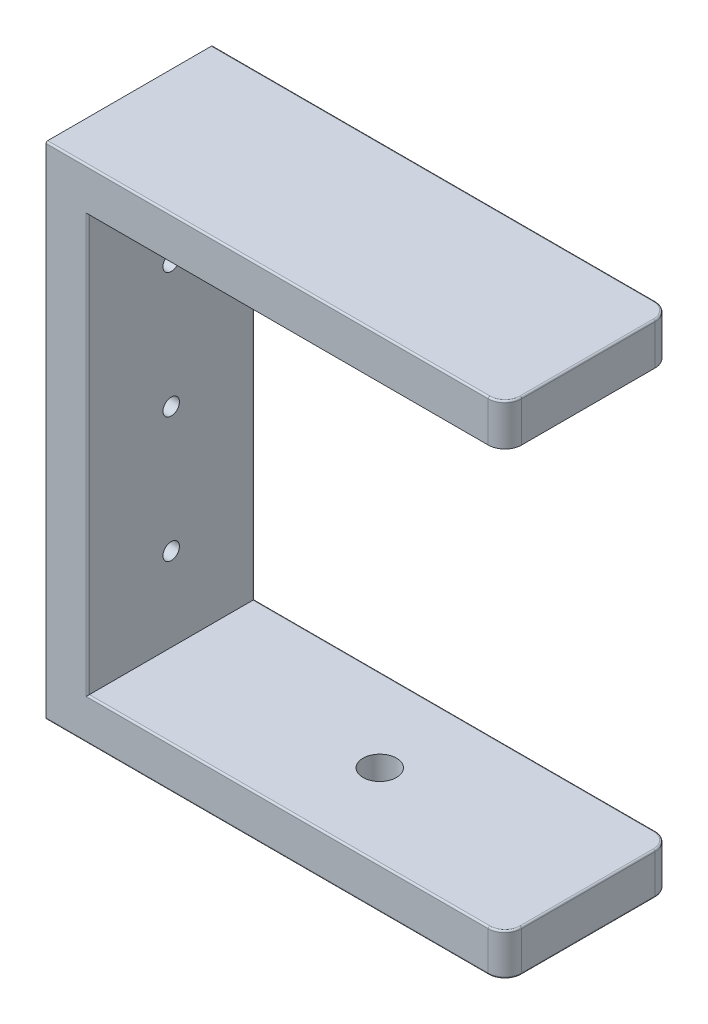
ISO-10303-21;
HEADER;
FILE_DESCRIPTION(('STEP AP214'),'2;1');
FILE_NAME('part.step','',(''),(''),'','','');
FILE_SCHEMA(('AUTOMOTIVE_DESIGN { 1 0 10303 214 1 1 1 1 }'));
ENDSEC;
DATA;
#1=APPLICATION_CONTEXT('core data for automotive mechanical design processes');
#2=APPLICATION_PROTOCOL_DEFINITION('international standard','automotive_design',2000,#1);
#3=PRODUCT_CONTEXT('',#1,'mechanical');
#4=PRODUCT('Part','Part','',(#3));
#5=PRODUCT_RELATED_PRODUCT_CATEGORY('part','',(#4));
#6=PRODUCT_DEFINITION_FORMATION('','',#4);
#7=PRODUCT_DEFINITION_CONTEXT('part definition',#1,'design');
#8=PRODUCT_DEFINITION('design','',#6,#7);
#9=PRODUCT_DEFINITION_SHAPE('','',#8);
#10=(LENGTH_UNIT() NAMED_UNIT(*) SI_UNIT(.MILLI.,.METRE.));
#11=(NAMED_UNIT(*) PLANE_ANGLE_UNIT() SI_UNIT($,.RADIAN.));
#12=(NAMED_UNIT(*) SI_UNIT($,.STERADIAN.) SOLID_ANGLE_UNIT());
#13=UNCERTAINTY_MEASURE_WITH_UNIT(LENGTH_MEASURE(1.E-05),#10,'distance_accuracy_value','');
#14=(GEOMETRIC_REPRESENTATION_CONTEXT(3) GLOBAL_UNCERTAINTY_ASSIGNED_CONTEXT((#13)) GLOBAL_UNIT_ASSIGNED_CONTEXT((#10,
#11,#12)) REPRESENTATION_CONTEXT('',''));
#15=CARTESIAN_POINT('',(0.,0.,0.));
#16=DIRECTION('',(0.,0.,1.));
#17=DIRECTION('',(1.,0.,0.));
#18=AXIS2_PLACEMENT_3D('',#15,#16,#17);
#19=CARTESIAN_POINT('',(0.,0.,25.4));
#20=DIRECTION('',(1.,0.,0.));
#21=DIRECTION('',(0.,0.,-1.));
#22=AXIS2_PLACEMENT_3D('',#19,#20,#21);
#23=PLANE('',#22);
#24=CARTESIAN_POINT('',(0.,57.15,12.7));
#25=DIRECTION('',(-1.,0.,0.));
#26=DIRECTION('',(0.,0.,1.));
#27=AXIS2_PLACEMENT_3D('',#24,#25,#26);
#28=CIRCLE('',#27,1.24999999999999);
#29=CARTESIAN_POINT('',(0.,57.15,13.95));
#30=VERTEX_POINT('',#29);
#31=EDGE_CURVE('E391',#30,#30,#28,.T.);
#32=ORIENTED_EDGE('',*,*,#31,.F.);
#33=EDGE_LOOP('',(#32));
#34=FACE_BOUND('',#33,.T.);
#35=CARTESIAN_POINT('',(0.,38.1,12.7));
#36=DIRECTION('',(-1.,0.,0.));
#37=DIRECTION('',(0.,0.,1.));
#38=AXIS2_PLACEMENT_3D('',#35,#36,#37);
#39=CIRCLE('',#38,1.24999999999999);
#40=CARTESIAN_POINT('',(0.,38.1,13.95));
#41=VERTEX_POINT('',#40);
#42=EDGE_CURVE('E390',#41,#41,#39,.T.);
#43=ORIENTED_EDGE('',*,*,#42,.F.);
#44=EDGE_LOOP('',(#43));
#45=FACE_BOUND('',#44,.T.);
#46=CARTESIAN_POINT('',(0.,19.05,12.7));
#47=DIRECTION('',(-1.,0.,0.));
#48=DIRECTION('',(0.,0.,1.));
#49=AXIS2_PLACEMENT_3D('',#46,#47,#48);
#50=CIRCLE('',#49,1.24999999999999);
#51=CARTESIAN_POINT('',(0.,19.05,13.95));
#52=VERTEX_POINT('',#51);
#53=EDGE_CURVE('E593',#52,#52,#50,.T.);
#54=ORIENTED_EDGE('',*,*,#53,.F.);
#55=EDGE_LOOP('',(#54));
#56=FACE_BOUND('',#55,.T.);
#57=DIRECTION('',(0.,-1.,0.));
#58=VECTOR('',#57,1.);
#59=CARTESIAN_POINT('',(0.,0.,0.));
#60=LINE('',#59,#58);
#61=CARTESIAN_POINT('',(0.,75.946,0.));
#62=VERTEX_POINT('',#61);
#63=CARTESIAN_POINT('',(0.,0.254,0.));
#64=VERTEX_POINT('',#63);
#65=EDGE_CURVE('E212',#62,#64,#60,.T.);
#66=ORIENTED_EDGE('',*,*,#65,.T.);
#67=CARTESIAN_POINT('',(0.,0.254,0.254000000000001));
#68=DIRECTION('',(1.,0.,0.));
#69=DIRECTION('',(0.,0.,-1.));
#70=AXIS2_PLACEMENT_3D('',#67,#68,#69);
#71=CIRCLE('',#70,0.254);
#72=CARTESIAN_POINT('',(0.,0.,0.254000000000001));
#73=VERTEX_POINT('',#72);
#74=EDGE_CURVE('E270',#64,#73,#71,.F.);
#75=ORIENTED_EDGE('',*,*,#74,.T.);
#76=DIRECTION('',(0.,0.,-1.));
#77=VECTOR('',#76,1.);
#78=CARTESIAN_POINT('',(0.,0.,25.4));
#79=LINE('',#78,#77);
#80=CARTESIAN_POINT('',(0.,0.,25.146));
#81=VERTEX_POINT('',#80);
#82=EDGE_CURVE('E383',#81,#73,#79,.T.);
#83=ORIENTED_EDGE('',*,*,#82,.F.);
#84=CARTESIAN_POINT('',(0.,0.254,25.146));
#85=DIRECTION('',(1.,0.,0.));
#86=DIRECTION('',(0.,0.,-1.));
#87=AXIS2_PLACEMENT_3D('',#84,#85,#86);
#88=CIRCLE('',#87,0.254);
#89=CARTESIAN_POINT('',(0.,0.254,25.4));
#90=VERTEX_POINT('',#89);
#91=EDGE_CURVE('E266',#81,#90,#88,.F.);
#92=ORIENTED_EDGE('',*,*,#91,.T.);
#93=DIRECTION('',(0.,-1.,0.));
#94=VECTOR('',#93,1.);
#95=CARTESIAN_POINT('',(0.,0.,25.4));
#96=LINE('',#95,#94);
#97=CARTESIAN_POINT('',(0.,75.946,25.4));
#98=VERTEX_POINT('',#97);
#99=EDGE_CURVE('E211',#98,#90,#96,.T.);
#100=ORIENTED_EDGE('',*,*,#99,.F.);
#101=CARTESIAN_POINT('',(0.,75.946,25.146));
#102=DIRECTION('',(1.,0.,0.));
#103=DIRECTION('',(0.,0.,-1.));
#104=AXIS2_PLACEMENT_3D('',#101,#102,#103);
#105=CIRCLE('',#104,0.254);
#106=CARTESIAN_POINT('',(0.,76.2,25.146));
#107=VERTEX_POINT('',#106);
#108=EDGE_CURVE('E264',#98,#107,#105,.F.);
#109=ORIENTED_EDGE('',*,*,#108,.T.);
#110=DIRECTION('',(0.,0.,-1.));
#111=VECTOR('',#110,1.);
#112=CARTESIAN_POINT('',(0.,76.2,25.4));
#113=LINE('',#112,#111);
#114=CARTESIAN_POINT('',(0.,76.2,0.254000000000001));
#115=VERTEX_POINT('',#114);
#116=EDGE_CURVE('E369',#107,#115,#113,.T.);
#117=ORIENTED_EDGE('',*,*,#116,.T.);
#118=CARTESIAN_POINT('',(0.,75.946,0.254000000000001));
#119=DIRECTION('',(1.,0.,0.));
#120=DIRECTION('',(0.,0.,-1.));
#121=AXIS2_PLACEMENT_3D('',#118,#119,#120);
#122=CIRCLE('',#121,0.254);
#123=EDGE_CURVE('E268',#115,#62,#122,.F.);
#124=ORIENTED_EDGE('',*,*,#123,.T.);
#125=EDGE_LOOP('',(#66,#75,#83,#92,#100,#109,#117,#124));
#126=FACE_BOUND('',#125,.T.);
#127=ADVANCED_FACE('F41',(#34,#45,#56,#126),#23,.F.);
#128=CARTESIAN_POINT('',(0.,0.,25.4));
#129=DIRECTION('',(0.,1.,0.));
#130=DIRECTION('',(0.,0.,1.));
#131=AXIS2_PLACEMENT_3D('',#128,#129,#130);
#132=PLANE('',#131);
#133=CARTESIAN_POINT('',(38.1,0.,12.7));
#134=DIRECTION('',(0.,-1.,0.));
#135=DIRECTION('',(0.,0.,-1.));
#136=AXIS2_PLACEMENT_3D('',#133,#134,#135);
#137=CIRCLE('',#136,2.5527);
#138=CARTESIAN_POINT('',(38.1,0.,10.1473));
#139=VERTEX_POINT('',#138);
#140=EDGE_CURVE('E320',#139,#139,#137,.T.);
#141=ORIENTED_EDGE('',*,*,#140,.F.);
#142=EDGE_LOOP('',(#141));
#143=FACE_BOUND('',#142,.T.);
#144=ORIENTED_EDGE('',*,*,#82,.T.);
#145=DIRECTION('',(1.,0.,0.));
#146=VECTOR('',#145,1.);
#147=CARTESIAN_POINT('',(67.31,0.,0.254000000000001));
#148=LINE('',#147,#146);
#149=CARTESIAN_POINT('',(67.31,0.,0.254));
#150=VERTEX_POINT('',#149);
#151=EDGE_CURVE('E261',#73,#150,#148,.T.);
#152=ORIENTED_EDGE('',*,*,#151,.T.);
#153=CARTESIAN_POINT('',(67.31,0.,2.54));
#154=DIRECTION('',(0.,1.,0.));
#155=DIRECTION('',(0.,0.,1.));
#156=AXIS2_PLACEMENT_3D('',#153,#154,#155);
#157=CIRCLE('',#156,2.286);
#158=CARTESIAN_POINT('',(69.596,0.,2.54));
#159=VERTEX_POINT('',#158);
#160=EDGE_CURVE('E259',#150,#159,#157,.F.);
#161=ORIENTED_EDGE('',*,*,#160,.T.);
#162=DIRECTION('',(0.,0.,-1.));
#163=VECTOR('',#162,1.);
#164=CARTESIAN_POINT('',(69.596,0.,25.4));
#165=LINE('',#164,#163);
#166=CARTESIAN_POINT('',(69.596,0.,22.86));
#167=VERTEX_POINT('',#166);
#168=EDGE_CURVE('E257',#159,#167,#165,.F.);
#169=ORIENTED_EDGE('',*,*,#168,.T.);
#170=CARTESIAN_POINT('',(67.31,0.,22.86));
#171=DIRECTION('',(0.,1.,0.));
#172=DIRECTION('',(0.,0.,1.));
#173=AXIS2_PLACEMENT_3D('',#170,#171,#172);
#174=CIRCLE('',#173,2.286);
#175=CARTESIAN_POINT('',(67.31,0.,25.146));
#176=VERTEX_POINT('',#175);
#177=EDGE_CURVE('E255',#167,#176,#174,.F.);
#178=ORIENTED_EDGE('',*,*,#177,.T.);
#179=DIRECTION('',(1.,0.,0.));
#180=VECTOR('',#179,1.);
#181=CARTESIAN_POINT('',(0.,0.,25.146));
#182=LINE('',#181,#180);
#183=EDGE_CURVE('E253',#176,#81,#182,.F.);
#184=ORIENTED_EDGE('',*,*,#183,.T.);
#185=EDGE_LOOP('',(#144,#152,#161,#169,#178,#184));
#186=FACE_BOUND('',#185,.T.);
#187=ADVANCED_FACE('F426',(#143,#186),#132,.F.);
#188=CARTESIAN_POINT('',(69.85,0.,25.4));
#189=DIRECTION('',(-1.,0.,0.));
#190=DIRECTION('',(0.,0.,1.));
#191=AXIS2_PLACEMENT_3D('',#188,#189,#190);
#192=PLANE('',#191);
#193=DIRECTION('',(0.,1.,0.));
#194=VECTOR('',#193,1.);
#195=CARTESIAN_POINT('',(69.85,6.35,2.54));
#196=LINE('',#195,#194);
#197=CARTESIAN_POINT('',(69.85,0.254,2.54));
#198=VERTEX_POINT('',#197);
#199=CARTESIAN_POINT('',(69.85,6.096,2.54));
#200=VERTEX_POINT('',#199);
#201=EDGE_CURVE('E203',#198,#200,#196,.T.);
#202=ORIENTED_EDGE('',*,*,#201,.T.);
#203=DIRECTION('',(0.,0.,-1.));
#204=VECTOR('',#203,1.);
#205=CARTESIAN_POINT('',(69.85,6.096,25.4));
#206=LINE('',#205,#204);
#207=CARTESIAN_POINT('',(69.85,6.096,22.86));
#208=VERTEX_POINT('',#207);
#209=EDGE_CURVE('E247',#200,#208,#206,.F.);
#210=ORIENTED_EDGE('',*,*,#209,.T.);
#211=DIRECTION('',(0.,1.,0.));
#212=VECTOR('',#211,1.);
#213=CARTESIAN_POINT('',(69.85,0.,22.86));
#214=LINE('',#213,#212);
#215=CARTESIAN_POINT('',(69.85,0.254,22.86));
#216=VERTEX_POINT('',#215);
#217=EDGE_CURVE('E386',#208,#216,#214,.F.);
#218=ORIENTED_EDGE('',*,*,#217,.T.);
#219=DIRECTION('',(0.,0.,-1.));
#220=VECTOR('',#219,1.);
#221=CARTESIAN_POINT('',(69.85,0.254,25.4));
#222=LINE('',#221,#220);
#223=EDGE_CURVE('E245',#216,#198,#222,.T.);
#224=ORIENTED_EDGE('',*,*,#223,.T.);
#225=EDGE_LOOP('',(#202,#210,#218,#224));
#226=FACE_BOUND('',#225,.T.);
#227=ADVANCED_FACE('F432',(#226),#192,.F.);
#228=CARTESIAN_POINT('',(69.85,6.35,25.4));
#229=DIRECTION('',(0.,-1.,0.));
#230=DIRECTION('',(1.,0.,0.));
#231=AXIS2_PLACEMENT_3D('',#228,#229,#230);
#232=PLANE('',#231);
#233=CARTESIAN_POINT('',(38.1,6.35,12.7));
#234=DIRECTION('',(0.,-1.,0.));
#235=DIRECTION('',(1.,0.,0.));
#236=AXIS2_PLACEMENT_3D('',#233,#234,#235);
#237=CIRCLE('',#236,2.5527);
#238=CARTESIAN_POINT('',(40.6527,6.35,12.7));
#239=VERTEX_POINT('',#238);
#240=EDGE_CURVE('E581',#239,#239,#237,.T.);
#241=ORIENTED_EDGE('',*,*,#240,.T.);
#242=EDGE_LOOP('',(#241));
#243=FACE_BOUND('',#242,.T.);
#244=CARTESIAN_POINT('',(67.31,6.35,2.54));
#245=DIRECTION('',(0.,-1.,0.));
#246=DIRECTION('',(1.,0.,0.));
#247=AXIS2_PLACEMENT_3D('',#244,#245,#246);
#248=CIRCLE('',#247,2.286);
#249=CARTESIAN_POINT('',(69.596,6.35,2.54));
#250=VERTEX_POINT('',#249);
#251=CARTESIAN_POINT('',(67.31,6.35,0.254));
#252=VERTEX_POINT('',#251);
#253=EDGE_CURVE('E229',#250,#252,#248,.F.);
#254=ORIENTED_EDGE('',*,*,#253,.T.);
#255=DIRECTION('',(-1.,0.,0.));
#256=VECTOR('',#255,1.);
#257=CARTESIAN_POINT('',(6.35000000000001,6.34999999999999,0.254000000000001));
#258=LINE('',#257,#256);
#259=CARTESIAN_POINT('',(6.35000000000001,6.34999999999999,0.254000000000001));
#260=VERTEX_POINT('',#259);
#261=EDGE_CURVE('E231',#252,#260,#258,.T.);
#262=ORIENTED_EDGE('',*,*,#261,.T.);
#263=DIRECTION('',(0.,0.,-1.));
#264=VECTOR('',#263,1.);
#265=CARTESIAN_POINT('',(6.35000000000001,6.34999999999999,25.4));
#266=LINE('',#265,#264);
#267=CARTESIAN_POINT('',(6.35000000000001,6.34999999999999,25.146));
#268=VERTEX_POINT('',#267);
#269=EDGE_CURVE('E381',#268,#260,#266,.T.);
#270=ORIENTED_EDGE('',*,*,#269,.F.);
#271=DIRECTION('',(-1.,0.,0.));
#272=VECTOR('',#271,1.);
#273=CARTESIAN_POINT('',(69.85,6.35,25.146));
#274=LINE('',#273,#272);
#275=CARTESIAN_POINT('',(67.31,6.35,25.146));
#276=VERTEX_POINT('',#275);
#277=EDGE_CURVE('E218',#268,#276,#274,.F.);
#278=ORIENTED_EDGE('',*,*,#277,.T.);
#279=CARTESIAN_POINT('',(67.31,6.35,22.86));
#280=DIRECTION('',(0.,-1.,0.));
#281=DIRECTION('',(1.,0.,0.));
#282=AXIS2_PLACEMENT_3D('',#279,#280,#281);
#283=CIRCLE('',#282,2.286);
#284=CARTESIAN_POINT('',(69.596,6.35,22.86));
#285=VERTEX_POINT('',#284);
#286=EDGE_CURVE('E221',#276,#285,#283,.F.);
#287=ORIENTED_EDGE('',*,*,#286,.T.);
#288=DIRECTION('',(0.,0.,-1.));
#289=VECTOR('',#288,1.);
#290=CARTESIAN_POINT('',(69.596,6.35,25.4));
#291=LINE('',#290,#289);
#292=EDGE_CURVE('E227',#285,#250,#291,.T.);
#293=ORIENTED_EDGE('',*,*,#292,.T.);
#294=EDGE_LOOP('',(#254,#262,#270,#278,#287,#293));
#295=FACE_BOUND('',#294,.T.);
#296=ADVANCED_FACE('F517',(#243,#295),#232,.F.);
#297=CARTESIAN_POINT('',(6.35,69.85,25.4));
#298=DIRECTION('',(-1.,0.,0.));
#299=DIRECTION('',(0.,-1.,0.));
#300=AXIS2_PLACEMENT_3D('',#297,#298,#299);
#301=PLANE('',#300);
#302=CARTESIAN_POINT('',(6.35,57.15,12.7));
#303=DIRECTION('',(-1.,0.,0.));
#304=DIRECTION('',(0.,-1.,0.));
#305=AXIS2_PLACEMENT_3D('',#302,#303,#304);
#306=CIRCLE('',#305,1.24999999999999);
#307=CARTESIAN_POINT('',(6.35,55.9,12.7));
#308=VERTEX_POINT('',#307);
#309=EDGE_CURVE('E387',#308,#308,#306,.T.);
#310=ORIENTED_EDGE('',*,*,#309,.T.);
#311=EDGE_LOOP('',(#310));
#312=FACE_BOUND('',#311,.T.);
#313=CARTESIAN_POINT('',(6.35,38.1,12.7));
#314=DIRECTION('',(-1.,0.,0.));
#315=DIRECTION('',(0.,-1.,0.));
#316=AXIS2_PLACEMENT_3D('',#313,#314,#315);
#317=CIRCLE('',#316,1.24999999999999);
#318=CARTESIAN_POINT('',(6.35,36.85,12.7));
#319=VERTEX_POINT('',#318);
#320=EDGE_CURVE('E591',#319,#319,#317,.T.);
#321=ORIENTED_EDGE('',*,*,#320,.T.);
#322=EDGE_LOOP('',(#321));
#323=FACE_BOUND('',#322,.T.);
#324=CARTESIAN_POINT('',(6.35000000000001,19.05,12.7));
#325=DIRECTION('',(-1.,0.,0.));
#326=DIRECTION('',(0.,-1.,0.));
#327=AXIS2_PLACEMENT_3D('',#324,#325,#326);
#328=CIRCLE('',#327,1.24999999999999);
#329=CARTESIAN_POINT('',(6.35000000000001,17.8,12.7));
#330=VERTEX_POINT('',#329);
#331=EDGE_CURVE('E372',#330,#330,#328,.T.);
#332=ORIENTED_EDGE('',*,*,#331,.T.);
#333=EDGE_LOOP('',(#332));
#334=FACE_BOUND('',#333,.T.);
#335=DIRECTION('',(0.,0.,-1.));
#336=VECTOR('',#335,1.);
#337=CARTESIAN_POINT('',(6.35,69.85,25.4));
#338=LINE('',#337,#336);
#339=CARTESIAN_POINT('',(6.35,69.85,25.146));
#340=VERTEX_POINT('',#339);
#341=CARTESIAN_POINT('',(6.35,69.85,0.254000000000001));
#342=VERTEX_POINT('',#341);
#343=EDGE_CURVE('E379',#340,#342,#338,.T.);
#344=ORIENTED_EDGE('',*,*,#343,.F.);
#345=DIRECTION('',(0.,1.,0.));
#346=VECTOR('',#345,1.);
#347=CARTESIAN_POINT('',(6.35,69.85,25.146));
#348=LINE('',#347,#346);
#349=EDGE_CURVE('E299',#340,#268,#348,.F.);
#350=ORIENTED_EDGE('',*,*,#349,.T.);
#351=ORIENTED_EDGE('',*,*,#269,.T.);
#352=DIRECTION('',(0.,1.,0.));
#353=VECTOR('',#352,1.);
#354=CARTESIAN_POINT('',(6.35,69.85,0.254000000000001));
#355=LINE('',#354,#353);
#356=EDGE_CURVE('E58',#260,#342,#355,.T.);
#357=ORIENTED_EDGE('',*,*,#356,.T.);
#358=EDGE_LOOP('',(#344,#350,#351,#357));
#359=FACE_BOUND('',#358,.T.);
#360=ADVANCED_FACE('F524',(#312,#323,#334,#359),#301,.F.);
#361=CARTESIAN_POINT('',(69.85,69.85,25.4));
#362=DIRECTION('',(0.,1.,0.));
#363=DIRECTION('',(-1.,0.,0.));
#364=AXIS2_PLACEMENT_3D('',#361,#362,#363);
#365=PLANE('',#364);
#366=DIRECTION('',(1.,0.,0.));
#367=VECTOR('',#366,1.);
#368=CARTESIAN_POINT('',(69.85,69.85,0.));
#369=LINE('',#368,#367);
#370=CARTESIAN_POINT('',(6.096,69.85,0.));
#371=VERTEX_POINT('',#370);
#372=CARTESIAN_POINT('',(67.31,69.85,0.));
#373=VERTEX_POINT('',#372);
#374=EDGE_CURVE('E195',#371,#373,#369,.T.);
#375=ORIENTED_EDGE('',*,*,#374,.T.);
#376=CARTESIAN_POINT('',(67.31,69.85,2.54));
#377=DIRECTION('',(0.,1.,0.));
#378=DIRECTION('',(-1.,0.,0.));
#379=AXIS2_PLACEMENT_3D('',#376,#377,#378);
#380=CIRCLE('',#379,2.54);
#381=CARTESIAN_POINT('',(69.85,69.85,2.54));
#382=VERTEX_POINT('',#381);
#383=EDGE_CURVE('E207',#373,#382,#380,.F.);
#384=ORIENTED_EDGE('',*,*,#383,.T.);
#385=DIRECTION('',(0.,0.,-1.));
#386=VECTOR('',#385,1.);
#387=CARTESIAN_POINT('',(69.85,69.85,25.4));
#388=LINE('',#387,#386);
#389=CARTESIAN_POINT('',(69.85,69.85,22.86));
#390=VERTEX_POINT('',#389);
#391=EDGE_CURVE('E377',#390,#382,#388,.T.);
#392=ORIENTED_EDGE('',*,*,#391,.F.);
#393=CARTESIAN_POINT('',(67.31,69.85,22.86));
#394=DIRECTION('',(0.,1.,0.));
#395=DIRECTION('',(-1.,0.,0.));
#396=AXIS2_PLACEMENT_3D('',#393,#394,#395);
#397=CIRCLE('',#396,2.54);
#398=CARTESIAN_POINT('',(67.31,69.85,25.4));
#399=VERTEX_POINT('',#398);
#400=EDGE_CURVE('E219',#390,#399,#397,.F.);
#401=ORIENTED_EDGE('',*,*,#400,.T.);
#402=DIRECTION('',(1.,0.,0.));
#403=VECTOR('',#402,1.);
#404=CARTESIAN_POINT('',(69.85,69.85,25.4));
#405=LINE('',#404,#403);
#406=CARTESIAN_POINT('',(6.096,69.85,25.4));
#407=VERTEX_POINT('',#406);
#408=EDGE_CURVE('E367',#407,#399,#405,.T.);
#409=ORIENTED_EDGE('',*,*,#408,.F.);
#410=CARTESIAN_POINT('',(6.096,69.85,25.146));
#411=DIRECTION('',(0.,1.,0.));
#412=DIRECTION('',(-1.,0.,0.));
#413=AXIS2_PLACEMENT_3D('',#410,#411,#412);
#414=CIRCLE('',#413,0.254);
#415=EDGE_CURVE('E50',#407,#340,#414,.T.);
#416=ORIENTED_EDGE('',*,*,#415,.T.);
#417=ORIENTED_EDGE('',*,*,#343,.T.);
#418=CARTESIAN_POINT('',(6.096,69.85,0.254000000000001));
#419=DIRECTION('',(0.,1.,0.));
#420=DIRECTION('',(-1.,0.,0.));
#421=AXIS2_PLACEMENT_3D('',#418,#419,#420);
#422=CIRCLE('',#421,0.254);
#423=EDGE_CURVE('E11',#342,#371,#422,.T.);
#424=ORIENTED_EDGE('',*,*,#423,.T.);
#425=EDGE_LOOP('',(#375,#384,#392,#401,#409,#416,#417,#424));
#426=FACE_BOUND('',#425,.T.);
#427=ADVANCED_FACE('F205',(#426),#365,.F.);
#428=CARTESIAN_POINT('',(69.85,69.85,25.4));
#429=DIRECTION('',(-1.,0.,0.));
#430=DIRECTION('',(0.,0.,1.));
#431=AXIS2_PLACEMENT_3D('',#428,#429,#430);
#432=PLANE('',#431);
#433=DIRECTION('',(0.,1.,0.));
#434=VECTOR('',#433,1.);
#435=CARTESIAN_POINT('',(69.85,76.2,2.54));
#436=LINE('',#435,#434);
#437=CARTESIAN_POINT('',(69.85,75.946,2.54));
#438=VERTEX_POINT('',#437);
#439=EDGE_CURVE('E217',#382,#438,#436,.T.);
#440=ORIENTED_EDGE('',*,*,#439,.T.);
#441=DIRECTION('',(0.,0.,-1.));
#442=VECTOR('',#441,1.);
#443=CARTESIAN_POINT('',(69.85,75.946,25.4));
#444=LINE('',#443,#442);
#445=CARTESIAN_POINT('',(69.85,75.946,22.86));
#446=VERTEX_POINT('',#445);
#447=EDGE_CURVE('E285',#438,#446,#444,.F.);
#448=ORIENTED_EDGE('',*,*,#447,.T.);
#449=DIRECTION('',(0.,1.,0.));
#450=VECTOR('',#449,1.);
#451=CARTESIAN_POINT('',(69.85,69.85,22.86));
#452=LINE('',#451,#450);
#453=EDGE_CURVE('E401',#446,#390,#452,.F.);
#454=ORIENTED_EDGE('',*,*,#453,.T.);
#455=ORIENTED_EDGE('',*,*,#391,.T.);
#456=EDGE_LOOP('',(#440,#448,#454,#455));
#457=FACE_BOUND('',#456,.T.);
#458=ADVANCED_FACE('F403',(#457),#432,.F.);
#459=CARTESIAN_POINT('',(0.,76.2,25.4));
#460=DIRECTION('',(0.,-1.,0.));
#461=DIRECTION('',(0.,0.,-1.));
#462=AXIS2_PLACEMENT_3D('',#459,#460,#461);
#463=PLANE('',#462);
#464=CARTESIAN_POINT('',(67.31,76.2,2.54));
#465=DIRECTION('',(0.,-1.,0.));
#466=DIRECTION('',(0.,0.,-1.));
#467=AXIS2_PLACEMENT_3D('',#464,#465,#466);
#468=CIRCLE('',#467,2.286);
#469=CARTESIAN_POINT('',(69.596,76.2,2.54));
#470=VERTEX_POINT('',#469);
#471=CARTESIAN_POINT('',(67.31,76.2,0.254));
#472=VERTEX_POINT('',#471);
#473=EDGE_CURVE('E278',#470,#472,#468,.F.);
#474=ORIENTED_EDGE('',*,*,#473,.T.);
#475=DIRECTION('',(-1.,0.,0.));
#476=VECTOR('',#475,1.);
#477=CARTESIAN_POINT('',(0.,76.2,0.254000000000001));
#478=LINE('',#477,#476);
#479=EDGE_CURVE('E280',#472,#115,#478,.T.);
#480=ORIENTED_EDGE('',*,*,#479,.T.);
#481=ORIENTED_EDGE('',*,*,#116,.F.);
#482=DIRECTION('',(-1.,0.,0.));
#483=VECTOR('',#482,1.);
#484=CARTESIAN_POINT('',(0.,76.2,25.146));
#485=LINE('',#484,#483);
#486=CARTESIAN_POINT('',(67.31,76.2,25.146));
#487=VERTEX_POINT('',#486);
#488=EDGE_CURVE('E272',#107,#487,#485,.F.);
#489=ORIENTED_EDGE('',*,*,#488,.T.);
#490=CARTESIAN_POINT('',(67.31,76.2,22.86));
#491=DIRECTION('',(0.,-1.,0.));
#492=DIRECTION('',(0.,0.,-1.));
#493=AXIS2_PLACEMENT_3D('',#490,#491,#492);
#494=CIRCLE('',#493,2.286);
#495=CARTESIAN_POINT('',(69.596,76.2,22.86));
#496=VERTEX_POINT('',#495);
#497=EDGE_CURVE('E274',#487,#496,#494,.F.);
#498=ORIENTED_EDGE('',*,*,#497,.T.);
#499=DIRECTION('',(0.,0.,-1.));
#500=VECTOR('',#499,1.);
#501=CARTESIAN_POINT('',(69.596,76.2,25.4));
#502=LINE('',#501,#500);
#503=EDGE_CURVE('E276',#496,#470,#502,.T.);
#504=ORIENTED_EDGE('',*,*,#503,.T.);
#505=EDGE_LOOP('',(#474,#480,#481,#489,#498,#504));
#506=FACE_BOUND('',#505,.T.);
#507=ADVANCED_FACE('F413',(#506),#463,.F.);
#508=CARTESIAN_POINT('',(0.,0.,25.4));
#509=DIRECTION('',(0.,0.,-1.));
#510=DIRECTION('',(-1.,0.,0.));
#511=AXIS2_PLACEMENT_3D('',#508,#509,#510);
#512=PLANE('',#511);
#513=ORIENTED_EDGE('',*,*,#99,.T.);
#514=DIRECTION('',(1.,0.,0.));
#515=VECTOR('',#514,1.);
#516=CARTESIAN_POINT('',(0.,0.254,25.4));
#517=LINE('',#516,#515);
#518=CARTESIAN_POINT('',(67.31,0.254,25.4));
#519=VERTEX_POINT('',#518);
#520=EDGE_CURVE('E296',#90,#519,#517,.T.);
#521=ORIENTED_EDGE('',*,*,#520,.T.);
#522=DIRECTION('',(0.,1.,0.));
#523=VECTOR('',#522,1.);
#524=CARTESIAN_POINT('',(67.31,0.,25.4));
#525=LINE('',#524,#523);
#526=CARTESIAN_POINT('',(67.31,6.096,25.4));
#527=VERTEX_POINT('',#526);
#528=EDGE_CURVE('E398',#519,#527,#525,.T.);
#529=ORIENTED_EDGE('',*,*,#528,.T.);
#530=DIRECTION('',(-1.,0.,0.));
#531=VECTOR('',#530,1.);
#532=CARTESIAN_POINT('',(0.,6.09599999999999,25.4));
#533=LINE('',#532,#531);
#534=CARTESIAN_POINT('',(6.09600000000001,6.09599999999999,25.4));
#535=VERTEX_POINT('',#534);
#536=EDGE_CURVE('E294',#527,#535,#533,.T.);
#537=ORIENTED_EDGE('',*,*,#536,.T.);
#538=DIRECTION('',(0.,1.,0.));
#539=VECTOR('',#538,1.);
#540=CARTESIAN_POINT('',(6.09600000000001,0.,25.4));
#541=LINE('',#540,#539);
#542=EDGE_CURVE('E291',#535,#407,#541,.T.);
#543=ORIENTED_EDGE('',*,*,#542,.T.);
#544=ORIENTED_EDGE('',*,*,#408,.T.);
#545=DIRECTION('',(0.,1.,0.));
#546=VECTOR('',#545,1.);
#547=CARTESIAN_POINT('',(67.31,0.,25.4));
#548=LINE('',#547,#546);
#549=CARTESIAN_POINT('',(67.31,75.946,25.4));
#550=VERTEX_POINT('',#549);
#551=EDGE_CURVE('E360',#399,#550,#548,.T.);
#552=ORIENTED_EDGE('',*,*,#551,.T.);
#553=DIRECTION('',(-1.,0.,0.));
#554=VECTOR('',#553,1.);
#555=CARTESIAN_POINT('',(0.,75.946,25.4));
#556=LINE('',#555,#554);
#557=EDGE_CURVE('E289',#550,#98,#556,.T.);
#558=ORIENTED_EDGE('',*,*,#557,.T.);
#559=EDGE_LOOP('',(#513,#521,#529,#537,#543,#544,#552,#558));
#560=FACE_BOUND('',#559,.T.);
#561=ADVANCED_FACE('F356',(#560),#512,.F.);
#562=CARTESIAN_POINT('',(0.,0.,0.));
#563=DIRECTION('',(0.,0.,-1.));
#564=DIRECTION('',(-1.,0.,0.));
#565=AXIS2_PLACEMENT_3D('',#562,#563,#564);
#566=PLANE('',#565);
#567=DIRECTION('',(0.,1.,0.));
#568=VECTOR('',#567,1.);
#569=CARTESIAN_POINT('',(67.31,0.,0.));
#570=LINE('',#569,#568);
#571=CARTESIAN_POINT('',(67.31,6.096,0.));
#572=VERTEX_POINT('',#571);
#573=CARTESIAN_POINT('',(67.31,0.254,0.));
#574=VERTEX_POINT('',#573);
#575=EDGE_CURVE('E202',#572,#574,#570,.F.);
#576=ORIENTED_EDGE('',*,*,#575,.T.);
#577=DIRECTION('',(1.,0.,0.));
#578=VECTOR('',#577,1.);
#579=CARTESIAN_POINT('',(0.,0.254,0.));
#580=LINE('',#579,#578);
#581=EDGE_CURVE('E239',#574,#64,#580,.F.);
#582=ORIENTED_EDGE('',*,*,#581,.T.);
#583=ORIENTED_EDGE('',*,*,#65,.F.);
#584=DIRECTION('',(-1.,0.,0.));
#585=VECTOR('',#584,1.);
#586=CARTESIAN_POINT('',(67.31,75.946,0.));
#587=LINE('',#586,#585);
#588=CARTESIAN_POINT('',(67.31,75.946,0.));
#589=VERTEX_POINT('',#588);
#590=EDGE_CURVE('E198',#62,#589,#587,.F.);
#591=ORIENTED_EDGE('',*,*,#590,.T.);
#592=DIRECTION('',(0.,1.,0.));
#593=VECTOR('',#592,1.);
#594=CARTESIAN_POINT('',(67.31,69.85,0.));
#595=LINE('',#594,#593);
#596=EDGE_CURVE('E191',#589,#373,#595,.F.);
#597=ORIENTED_EDGE('',*,*,#596,.T.);
#598=ORIENTED_EDGE('',*,*,#374,.F.);
#599=DIRECTION('',(0.,1.,0.));
#600=VECTOR('',#599,1.);
#601=CARTESIAN_POINT('',(6.09600000000001,6.34999999999999,0.));
#602=LINE('',#601,#600);
#603=CARTESIAN_POINT('',(6.09600000000001,6.09599999999999,0.));
#604=VERTEX_POINT('',#603);
#605=EDGE_CURVE('E234',#371,#604,#602,.F.);
#606=ORIENTED_EDGE('',*,*,#605,.T.);
#607=DIRECTION('',(-1.,0.,0.));
#608=VECTOR('',#607,1.);
#609=CARTESIAN_POINT('',(67.31,6.096,0.));
#610=LINE('',#609,#608);
#611=EDGE_CURVE('E236',#604,#572,#610,.F.);
#612=ORIENTED_EDGE('',*,*,#611,.T.);
#613=EDGE_LOOP('',(#576,#582,#583,#591,#597,#598,#606,#612));
#614=FACE_BOUND('',#613,.T.);
#615=ADVANCED_FACE('F194',(#614),#566,.T.);
#616=CARTESIAN_POINT('',(0.,19.05,12.7));
#617=DIRECTION('',(-1.,0.,0.));
#618=DIRECTION('',(0.,0.,1.));
#619=AXIS2_PLACEMENT_3D('',#616,#617,#618);
#620=CYLINDRICAL_SURFACE('',#619,1.24999999999999);
#621=ORIENTED_EDGE('',*,*,#53,.T.);
#622=EDGE_LOOP('',(#621));
#623=FACE_BOUND('',#622,.T.);
#624=ORIENTED_EDGE('',*,*,#331,.F.);
#625=EDGE_LOOP('',(#624));
#626=FACE_BOUND('',#625,.T.);
#627=ADVANCED_FACE('F560',(#623,#626),#620,.F.);
#628=CARTESIAN_POINT('',(0.,38.1,12.7));
#629=DIRECTION('',(-1.,0.,0.));
#630=DIRECTION('',(0.,0.,1.));
#631=AXIS2_PLACEMENT_3D('',#628,#629,#630);
#632=CYLINDRICAL_SURFACE('',#631,1.24999999999999);
#633=ORIENTED_EDGE('',*,*,#42,.T.);
#634=EDGE_LOOP('',(#633));
#635=FACE_BOUND('',#634,.T.);
#636=ORIENTED_EDGE('',*,*,#320,.F.);
#637=EDGE_LOOP('',(#636));
#638=FACE_BOUND('',#637,.T.);
#639=ADVANCED_FACE('F565',(#635,#638),#632,.F.);
#640=CARTESIAN_POINT('',(0.,57.15,12.7));
#641=DIRECTION('',(-1.,0.,0.));
#642=DIRECTION('',(0.,0.,1.));
#643=AXIS2_PLACEMENT_3D('',#640,#641,#642);
#644=CYLINDRICAL_SURFACE('',#643,1.24999999999999);
#645=ORIENTED_EDGE('',*,*,#31,.T.);
#646=EDGE_LOOP('',(#645));
#647=FACE_BOUND('',#646,.T.);
#648=ORIENTED_EDGE('',*,*,#309,.F.);
#649=EDGE_LOOP('',(#648));
#650=FACE_BOUND('',#649,.T.);
#651=ADVANCED_FACE('F569',(#647,#650),#644,.F.);
#652=CARTESIAN_POINT('',(38.1,0.,12.7));
#653=DIRECTION('',(0.,-1.,0.));
#654=DIRECTION('',(0.,0.,-1.));
#655=AXIS2_PLACEMENT_3D('',#652,#653,#654);
#656=CYLINDRICAL_SURFACE('',#655,2.5527);
#657=ORIENTED_EDGE('',*,*,#240,.F.);
#658=EDGE_LOOP('',(#657));
#659=FACE_BOUND('',#658,.T.);
#660=ORIENTED_EDGE('',*,*,#140,.T.);
#661=EDGE_LOOP('',(#660));
#662=FACE_BOUND('',#661,.T.);
#663=ADVANCED_FACE('F443',(#659,#662),#656,.F.);
#664=CARTESIAN_POINT('',(67.31,0.,2.54));
#665=DIRECTION('',(0.,-1.,0.));
#666=DIRECTION('',(0.,0.,-1.));
#667=AXIS2_PLACEMENT_3D('',#664,#665,#666);
#668=CYLINDRICAL_SURFACE('',#667,2.54);
#669=ORIENTED_EDGE('',*,*,#575,.F.);
#670=CARTESIAN_POINT('',(67.31,6.096,2.54));
#671=DIRECTION('',(0.,-1.,0.));
#672=DIRECTION('',(1.,0.,0.));
#673=AXIS2_PLACEMENT_3D('',#670,#671,#672);
#674=CIRCLE('',#673,2.54);
#675=EDGE_CURVE('E243',#572,#200,#674,.T.);
#676=ORIENTED_EDGE('',*,*,#675,.T.);
#677=ORIENTED_EDGE('',*,*,#201,.F.);
#678=CARTESIAN_POINT('',(67.31,0.254,2.54));
#679=DIRECTION('',(0.,1.,0.));
#680=DIRECTION('',(0.,0.,1.));
#681=AXIS2_PLACEMENT_3D('',#678,#679,#680);
#682=CIRCLE('',#681,2.54);
#683=EDGE_CURVE('E241',#198,#574,#682,.T.);
#684=ORIENTED_EDGE('',*,*,#683,.T.);
#685=EDGE_LOOP('',(#669,#676,#677,#684));
#686=FACE_BOUND('',#685,.T.);
#687=ADVANCED_FACE('F439',(#686),#668,.T.);
#688=CARTESIAN_POINT('',(67.31,0.,22.86));
#689=DIRECTION('',(0.,1.,0.));
#690=DIRECTION('',(0.,0.,1.));
#691=AXIS2_PLACEMENT_3D('',#688,#689,#690);
#692=CYLINDRICAL_SURFACE('',#691,2.54);
#693=ORIENTED_EDGE('',*,*,#217,.F.);
#694=CARTESIAN_POINT('',(67.31,6.096,22.86));
#695=DIRECTION('',(0.,-1.,0.));
#696=DIRECTION('',(1.,0.,0.));
#697=AXIS2_PLACEMENT_3D('',#694,#695,#696);
#698=CIRCLE('',#697,2.54);
#699=EDGE_CURVE('E251',#208,#527,#698,.T.);
#700=ORIENTED_EDGE('',*,*,#699,.T.);
#701=ORIENTED_EDGE('',*,*,#528,.F.);
#702=CARTESIAN_POINT('',(67.31,0.254,22.86));
#703=DIRECTION('',(0.,1.,0.));
#704=DIRECTION('',(0.,0.,1.));
#705=AXIS2_PLACEMENT_3D('',#702,#703,#704);
#706=CIRCLE('',#705,2.54);
#707=EDGE_CURVE('E249',#519,#216,#706,.T.);
#708=ORIENTED_EDGE('',*,*,#707,.T.);
#709=EDGE_LOOP('',(#693,#700,#701,#708));
#710=FACE_BOUND('',#709,.T.);
#711=ADVANCED_FACE('F442',(#710),#692,.T.);
#712=CARTESIAN_POINT('',(67.31,69.85,2.54));
#713=DIRECTION('',(0.,-1.,0.));
#714=DIRECTION('',(0.,0.,-1.));
#715=AXIS2_PLACEMENT_3D('',#712,#713,#714);
#716=CYLINDRICAL_SURFACE('',#715,2.54);
#717=ORIENTED_EDGE('',*,*,#596,.F.);
#718=CARTESIAN_POINT('',(67.31,75.946,2.54));
#719=DIRECTION('',(0.,-1.,0.));
#720=DIRECTION('',(0.,0.,-1.));
#721=AXIS2_PLACEMENT_3D('',#718,#719,#720);
#722=CIRCLE('',#721,2.54);
#723=EDGE_CURVE('E283',#589,#438,#722,.T.);
#724=ORIENTED_EDGE('',*,*,#723,.T.);
#725=ORIENTED_EDGE('',*,*,#439,.F.);
#726=ORIENTED_EDGE('',*,*,#383,.F.);
#727=EDGE_LOOP('',(#717,#724,#725,#726));
#728=FACE_BOUND('',#727,.T.);
#729=ADVANCED_FACE('F215',(#728),#716,.T.);
#730=CARTESIAN_POINT('',(67.31,0.,22.86));
#731=DIRECTION('',(0.,1.,0.));
#732=DIRECTION('',(0.,0.,1.));
#733=AXIS2_PLACEMENT_3D('',#730,#731,#732);
#734=CYLINDRICAL_SURFACE('',#733,2.54);
#735=ORIENTED_EDGE('',*,*,#453,.F.);
#736=CARTESIAN_POINT('',(67.31,75.946,22.86));
#737=DIRECTION('',(0.,-1.,0.));
#738=DIRECTION('',(0.,0.,-1.));
#739=AXIS2_PLACEMENT_3D('',#736,#737,#738);
#740=CIRCLE('',#739,2.54);
#741=EDGE_CURVE('E287',#446,#550,#740,.T.);
#742=ORIENTED_EDGE('',*,*,#741,.T.);
#743=ORIENTED_EDGE('',*,*,#551,.F.);
#744=ORIENTED_EDGE('',*,*,#400,.F.);
#745=EDGE_LOOP('',(#735,#742,#743,#744));
#746=FACE_BOUND('',#745,.T.);
#747=ADVANCED_FACE('F450',(#746),#734,.T.);
#748=CARTESIAN_POINT('',(6.09600000000001,0.,25.146));
#749=DIRECTION('',(0.,1.,0.));
#750=DIRECTION('',(-1.,0.,0.));
#751=AXIS2_PLACEMENT_3D('',#748,#749,#750);
#752=CYLINDRICAL_SURFACE('',#751,0.254);
#753=ORIENTED_EDGE('',*,*,#415,.F.);
#754=ORIENTED_EDGE('',*,*,#542,.F.);
#755=CARTESIAN_POINT('',(6.09600000000001,6.09599999999999,25.146));
#756=DIRECTION('',(-0.707106781186548,0.707106781186547,0.));
#757=DIRECTION('',(-0.707106781186547,-0.707106781186548,0.));
#758=AXIS2_PLACEMENT_3D('',#755,#756,#757);
#759=ELLIPSE('',#758,0.359210244842766,0.254);
#760=EDGE_CURVE('E317',#268,#535,#759,.F.);
#761=ORIENTED_EDGE('',*,*,#760,.F.);
#762=ORIENTED_EDGE('',*,*,#349,.F.);
#763=EDGE_LOOP('',(#753,#754,#761,#762));
#764=FACE_BOUND('',#763,.T.);
#765=ADVANCED_FACE('F453',(#764),#752,.T.);
#766=CARTESIAN_POINT('',(0.,6.09599999999999,25.146));
#767=DIRECTION('',(-1.,0.,0.));
#768=DIRECTION('',(0.,-1.,0.));
#769=AXIS2_PLACEMENT_3D('',#766,#767,#768);
#770=CYLINDRICAL_SURFACE('',#769,0.254);
#771=ORIENTED_EDGE('',*,*,#760,.T.);
#772=ORIENTED_EDGE('',*,*,#536,.F.);
#773=CARTESIAN_POINT('',(67.31,6.096,25.146));
#774=DIRECTION('',(1.,0.,0.));
#775=DIRECTION('',(0.,0.,-1.));
#776=AXIS2_PLACEMENT_3D('',#773,#774,#775);
#777=CIRCLE('',#776,0.254);
#778=EDGE_CURVE('E314',#276,#527,#777,.T.);
#779=ORIENTED_EDGE('',*,*,#778,.F.);
#780=ORIENTED_EDGE('',*,*,#277,.F.);
#781=EDGE_LOOP('',(#771,#772,#779,#780));
#782=FACE_BOUND('',#781,.T.);
#783=ADVANCED_FACE('F475',(#782),#770,.T.);
#784=CARTESIAN_POINT('',(67.31,6.096,22.86));
#785=DIRECTION('',(0.,-1.,0.));
#786=DIRECTION('',(1.,0.,0.));
#787=AXIS2_PLACEMENT_3D('',#784,#785,#786);
#788=TOROIDAL_SURFACE('',#787,2.286,0.254);
#789=ORIENTED_EDGE('',*,*,#778,.T.);
#790=ORIENTED_EDGE('',*,*,#699,.F.);
#791=CARTESIAN_POINT('',(69.596,6.096,22.86));
#792=DIRECTION('',(0.,0.,-1.));
#793=DIRECTION('',(-1.,0.,0.));
#794=AXIS2_PLACEMENT_3D('',#791,#792,#793);
#795=CIRCLE('',#794,0.254);
#796=EDGE_CURVE('E311',#285,#208,#795,.T.);
#797=ORIENTED_EDGE('',*,*,#796,.F.);
#798=ORIENTED_EDGE('',*,*,#286,.F.);
#799=EDGE_LOOP('',(#789,#790,#797,#798));
#800=FACE_BOUND('',#799,.T.);
#801=ADVANCED_FACE('F471',(#800),#788,.T.);
#802=CARTESIAN_POINT('',(69.596,6.096,25.4));
#803=DIRECTION('',(0.,0.,-1.));
#804=DIRECTION('',(-1.,0.,0.));
#805=AXIS2_PLACEMENT_3D('',#802,#803,#804);
#806=CYLINDRICAL_SURFACE('',#805,0.254);
#807=ORIENTED_EDGE('',*,*,#796,.T.);
#808=ORIENTED_EDGE('',*,*,#209,.F.);
#809=CARTESIAN_POINT('',(69.596,6.096,2.54));
#810=DIRECTION('',(0.,0.,-1.));
#811=DIRECTION('',(-1.,0.,0.));
#812=AXIS2_PLACEMENT_3D('',#809,#810,#811);
#813=CIRCLE('',#812,0.254);
#814=EDGE_CURVE('E308',#250,#200,#813,.T.);
#815=ORIENTED_EDGE('',*,*,#814,.F.);
#816=ORIENTED_EDGE('',*,*,#292,.F.);
#817=EDGE_LOOP('',(#807,#808,#815,#816));
#818=FACE_BOUND('',#817,.T.);
#819=ADVANCED_FACE('F467',(#818),#806,.T.);
#820=CARTESIAN_POINT('',(67.31,6.096,2.54));
#821=DIRECTION('',(0.,-1.,0.));
#822=DIRECTION('',(1.,0.,0.));
#823=AXIS2_PLACEMENT_3D('',#820,#821,#822);
#824=TOROIDAL_SURFACE('',#823,2.286,0.254);
#825=ORIENTED_EDGE('',*,*,#814,.T.);
#826=ORIENTED_EDGE('',*,*,#675,.F.);
#827=CARTESIAN_POINT('',(67.31,6.096,0.254));
#828=DIRECTION('',(-1.,0.,0.));
#829=DIRECTION('',(0.,0.,1.));
#830=AXIS2_PLACEMENT_3D('',#827,#828,#829);
#831=CIRCLE('',#830,0.254);
#832=EDGE_CURVE('E304',#252,#572,#831,.T.);
#833=ORIENTED_EDGE('',*,*,#832,.F.);
#834=ORIENTED_EDGE('',*,*,#253,.F.);
#835=EDGE_LOOP('',(#825,#826,#833,#834));
#836=FACE_BOUND('',#835,.T.);
#837=ADVANCED_FACE('F463',(#836),#824,.T.);
#838=CARTESIAN_POINT('',(6.096,69.85,0.254000000000001));
#839=DIRECTION('',(0.,-1.,0.));
#840=DIRECTION('',(1.,0.,0.));
#841=AXIS2_PLACEMENT_3D('',#838,#839,#840);
#842=CYLINDRICAL_SURFACE('',#841,0.254);
#843=ORIENTED_EDGE('',*,*,#423,.F.);
#844=ORIENTED_EDGE('',*,*,#356,.F.);
#845=CARTESIAN_POINT('',(6.09600000000001,6.09599999999999,0.254000000000001));
#846=DIRECTION('',(0.707106781186548,-0.707106781186547,0.));
#847=DIRECTION('',(0.707106781186547,0.707106781186548,0.));
#848=AXIS2_PLACEMENT_3D('',#845,#846,#847);
#849=ELLIPSE('',#848,0.359210244842766,0.254);
#850=EDGE_CURVE('E302',#604,#260,#849,.T.);
#851=ORIENTED_EDGE('',*,*,#850,.F.);
#852=ORIENTED_EDGE('',*,*,#605,.F.);
#853=EDGE_LOOP('',(#843,#844,#851,#852));
#854=FACE_BOUND('',#853,.T.);
#855=ADVANCED_FACE('F459',(#854),#842,.T.);
#856=CARTESIAN_POINT('',(69.85,6.096,0.254000000000001));
#857=DIRECTION('',(1.,0.,0.));
#858=DIRECTION('',(0.,1.,0.));
#859=AXIS2_PLACEMENT_3D('',#856,#857,#858);
#860=CYLINDRICAL_SURFACE('',#859,0.254);
#861=ORIENTED_EDGE('',*,*,#832,.T.);
#862=ORIENTED_EDGE('',*,*,#611,.F.);
#863=ORIENTED_EDGE('',*,*,#850,.T.);
#864=ORIENTED_EDGE('',*,*,#261,.F.);
#865=EDGE_LOOP('',(#861,#862,#863,#864));
#866=FACE_BOUND('',#865,.T.);
#867=ADVANCED_FACE('F455',(#866),#860,.T.);
#868=CARTESIAN_POINT('',(0.,0.254,25.146));
#869=DIRECTION('',(1.,0.,0.));
#870=DIRECTION('',(0.,0.,-1.));
#871=AXIS2_PLACEMENT_3D('',#868,#869,#870);
#872=CYLINDRICAL_SURFACE('',#871,0.254);
#873=ORIENTED_EDGE('',*,*,#91,.F.);
#874=ORIENTED_EDGE('',*,*,#183,.F.);
#875=CARTESIAN_POINT('',(67.31,0.254,25.146));
#876=DIRECTION('',(1.,0.,0.));
#877=DIRECTION('',(0.,0.,-1.));
#878=AXIS2_PLACEMENT_3D('',#875,#876,#877);
#879=CIRCLE('',#878,0.254);
#880=EDGE_CURVE('E305',#519,#176,#879,.T.);
#881=ORIENTED_EDGE('',*,*,#880,.F.);
#882=ORIENTED_EDGE('',*,*,#520,.F.);
#883=EDGE_LOOP('',(#873,#874,#881,#882));
#884=FACE_BOUND('',#883,.T.);
#885=ADVANCED_FACE('F458',(#884),#872,.T.);
#886=CARTESIAN_POINT('',(67.31,0.254,22.86));
#887=DIRECTION('',(0.,1.,0.));
#888=DIRECTION('',(0.,0.,1.));
#889=AXIS2_PLACEMENT_3D('',#886,#887,#888);
#890=TOROIDAL_SURFACE('',#889,2.286,0.254);
#891=ORIENTED_EDGE('',*,*,#880,.T.);
#892=ORIENTED_EDGE('',*,*,#177,.F.);
#893=CARTESIAN_POINT('',(69.596,0.254,22.86));
#894=DIRECTION('',(0.,0.,-1.));
#895=DIRECTION('',(-1.,0.,0.));
#896=AXIS2_PLACEMENT_3D('',#893,#894,#895);
#897=CIRCLE('',#896,0.254);
#898=EDGE_CURVE('E326',#216,#167,#897,.T.);
#899=ORIENTED_EDGE('',*,*,#898,.F.);
#900=ORIENTED_EDGE('',*,*,#707,.F.);
#901=EDGE_LOOP('',(#891,#892,#899,#900));
#902=FACE_BOUND('',#901,.T.);
#903=ADVANCED_FACE('F494',(#902),#890,.T.);
#904=CARTESIAN_POINT('',(69.596,0.254,25.4));
#905=DIRECTION('',(0.,0.,-1.));
#906=DIRECTION('',(-1.,0.,0.));
#907=AXIS2_PLACEMENT_3D('',#904,#905,#906);
#908=CYLINDRICAL_SURFACE('',#907,0.254);
#909=ORIENTED_EDGE('',*,*,#898,.T.);
#910=ORIENTED_EDGE('',*,*,#168,.F.);
#911=CARTESIAN_POINT('',(69.596,0.254,2.54));
#912=DIRECTION('',(0.,0.,-1.));
#913=DIRECTION('',(-1.,0.,0.));
#914=AXIS2_PLACEMENT_3D('',#911,#912,#913);
#915=CIRCLE('',#914,0.254);
#916=EDGE_CURVE('E323',#198,#159,#915,.T.);
#917=ORIENTED_EDGE('',*,*,#916,.F.);
#918=ORIENTED_EDGE('',*,*,#223,.F.);
#919=EDGE_LOOP('',(#909,#910,#917,#918));
#920=FACE_BOUND('',#919,.T.);
#921=ADVANCED_FACE('F490',(#920),#908,.T.);
#922=CARTESIAN_POINT('',(67.31,0.254,2.54));
#923=DIRECTION('',(0.,1.,0.));
#924=DIRECTION('',(0.,0.,1.));
#925=AXIS2_PLACEMENT_3D('',#922,#923,#924);
#926=TOROIDAL_SURFACE('',#925,2.286,0.254);
#927=ORIENTED_EDGE('',*,*,#916,.T.);
#928=ORIENTED_EDGE('',*,*,#160,.F.);
#929=CARTESIAN_POINT('',(67.31,0.254,0.254));
#930=DIRECTION('',(-1.,0.,0.));
#931=DIRECTION('',(0.,0.,1.));
#932=AXIS2_PLACEMENT_3D('',#929,#930,#931);
#933=CIRCLE('',#932,0.254);
#934=EDGE_CURVE('E321',#574,#150,#933,.T.);
#935=ORIENTED_EDGE('',*,*,#934,.F.);
#936=ORIENTED_EDGE('',*,*,#683,.F.);
#937=EDGE_LOOP('',(#927,#928,#935,#936));
#938=FACE_BOUND('',#937,.T.);
#939=ADVANCED_FACE('F486',(#938),#926,.T.);
#940=CARTESIAN_POINT('',(0.,0.254,0.254000000000001));
#941=DIRECTION('',(-1.,0.,0.));
#942=DIRECTION('',(0.,0.,1.));
#943=AXIS2_PLACEMENT_3D('',#940,#941,#942);
#944=CYLINDRICAL_SURFACE('',#943,0.254);
#945=ORIENTED_EDGE('',*,*,#74,.F.);
#946=ORIENTED_EDGE('',*,*,#581,.F.);
#947=ORIENTED_EDGE('',*,*,#934,.T.);
#948=ORIENTED_EDGE('',*,*,#151,.F.);
#949=EDGE_LOOP('',(#945,#946,#947,#948));
#950=FACE_BOUND('',#949,.T.);
#951=ADVANCED_FACE('F483',(#950),#944,.T.);
#952=CARTESIAN_POINT('',(0.,75.946,25.146));
#953=DIRECTION('',(-1.,0.,0.));
#954=DIRECTION('',(0.,0.,1.));
#955=AXIS2_PLACEMENT_3D('',#952,#953,#954);
#956=CYLINDRICAL_SURFACE('',#955,0.254);
#957=ORIENTED_EDGE('',*,*,#108,.F.);
#958=ORIENTED_EDGE('',*,*,#557,.F.);
#959=CARTESIAN_POINT('',(67.31,75.946,25.146));
#960=DIRECTION('',(1.,0.,0.));
#961=DIRECTION('',(0.,0.,-1.));
#962=AXIS2_PLACEMENT_3D('',#959,#960,#961);
#963=CIRCLE('',#962,0.254);
#964=EDGE_CURVE('E45',#487,#550,#963,.T.);
#965=ORIENTED_EDGE('',*,*,#964,.F.);
#966=ORIENTED_EDGE('',*,*,#488,.F.);
#967=EDGE_LOOP('',(#957,#958,#965,#966));
#968=FACE_BOUND('',#967,.T.);
#969=ADVANCED_FACE('F43',(#968),#956,.T.);
#970=CARTESIAN_POINT('',(67.31,75.946,22.86));
#971=DIRECTION('',(0.,-1.,0.));
#972=DIRECTION('',(0.,0.,-1.));
#973=AXIS2_PLACEMENT_3D('',#970,#971,#972);
#974=TOROIDAL_SURFACE('',#973,2.286,0.254);
#975=ORIENTED_EDGE('',*,*,#964,.T.);
#976=ORIENTED_EDGE('',*,*,#741,.F.);
#977=CARTESIAN_POINT('',(69.596,75.946,22.86));
#978=DIRECTION('',(0.,0.,-1.));
#979=DIRECTION('',(-1.,0.,0.));
#980=AXIS2_PLACEMENT_3D('',#977,#978,#979);
#981=CIRCLE('',#980,0.254);
#982=EDGE_CURVE('E336',#496,#446,#981,.T.);
#983=ORIENTED_EDGE('',*,*,#982,.F.);
#984=ORIENTED_EDGE('',*,*,#497,.F.);
#985=EDGE_LOOP('',(#975,#976,#983,#984));
#986=FACE_BOUND('',#985,.T.);
#987=ADVANCED_FACE('F347',(#986),#974,.T.);
#988=CARTESIAN_POINT('',(69.596,75.946,25.4));
#989=DIRECTION('',(0.,0.,-1.));
#990=DIRECTION('',(-1.,0.,0.));
#991=AXIS2_PLACEMENT_3D('',#988,#989,#990);
#992=CYLINDRICAL_SURFACE('',#991,0.254);
#993=ORIENTED_EDGE('',*,*,#982,.T.);
#994=ORIENTED_EDGE('',*,*,#447,.F.);
#995=CARTESIAN_POINT('',(69.596,75.946,2.54));
#996=DIRECTION('',(0.,0.,-1.));
#997=DIRECTION('',(-1.,0.,0.));
#998=AXIS2_PLACEMENT_3D('',#995,#996,#997);
#999=CIRCLE('',#998,0.254);
#1000=EDGE_CURVE('E334',#470,#438,#999,.T.);
#1001=ORIENTED_EDGE('',*,*,#1000,.F.);
#1002=ORIENTED_EDGE('',*,*,#503,.F.);
#1003=EDGE_LOOP('',(#993,#994,#1001,#1002));
#1004=FACE_BOUND('',#1003,.T.);
#1005=ADVANCED_FACE('F406',(#1004),#992,.T.);
#1006=CARTESIAN_POINT('',(67.31,75.946,2.54));
#1007=DIRECTION('',(0.,-1.,0.));
#1008=DIRECTION('',(0.,0.,-1.));
#1009=AXIS2_PLACEMENT_3D('',#1006,#1007,#1008);
#1010=TOROIDAL_SURFACE('',#1009,2.286,0.254);
#1011=ORIENTED_EDGE('',*,*,#1000,.T.);
#1012=ORIENTED_EDGE('',*,*,#723,.F.);
#1013=CARTESIAN_POINT('',(67.31,75.946,0.254));
#1014=DIRECTION('',(-1.,0.,0.));
#1015=DIRECTION('',(0.,0.,1.));
#1016=AXIS2_PLACEMENT_3D('',#1013,#1014,#1015);
#1017=CIRCLE('',#1016,0.254);
#1018=EDGE_CURVE('E331',#472,#589,#1017,.T.);
#1019=ORIENTED_EDGE('',*,*,#1018,.F.);
#1020=ORIENTED_EDGE('',*,*,#473,.F.);
#1021=EDGE_LOOP('',(#1011,#1012,#1019,#1020));
#1022=FACE_BOUND('',#1021,.T.);
#1023=ADVANCED_FACE('F409',(#1022),#1010,.T.);
#1024=CARTESIAN_POINT('',(0.,75.946,0.254000000000001));
#1025=DIRECTION('',(1.,0.,0.));
#1026=DIRECTION('',(0.,0.,-1.));
#1027=AXIS2_PLACEMENT_3D('',#1024,#1025,#1026);
#1028=CYLINDRICAL_SURFACE('',#1027,0.254);
#1029=ORIENTED_EDGE('',*,*,#1018,.T.);
#1030=ORIENTED_EDGE('',*,*,#590,.F.);
#1031=ORIENTED_EDGE('',*,*,#123,.F.);
#1032=ORIENTED_EDGE('',*,*,#479,.F.);
#1033=EDGE_LOOP('',(#1029,#1030,#1031,#1032));
#1034=FACE_BOUND('',#1033,.T.);
#1035=ADVANCED_FACE('F417',(#1034),#1028,.T.);
#1036=CLOSED_SHELL('',(#127,#187,#227,#296,#360,#427,#458,#507,#561,#615,#627,#639,#651,#663,
#687,#711,#729,#747,#765,#783,#801,#819,#837,#855,#867,#885,#903,#921,#939,#951,#969,#987,#1005,
#1023,#1035));
#1037=MANIFOLD_SOLID_BREP('B2',#1036);
#1038=ADVANCED_BREP_SHAPE_REPRESENTATION('',(#18,#1037),#14);
#1039=SHAPE_DEFINITION_REPRESENTATION(#9,#1038);
ENDSEC;
END-ISO-10303-21;
